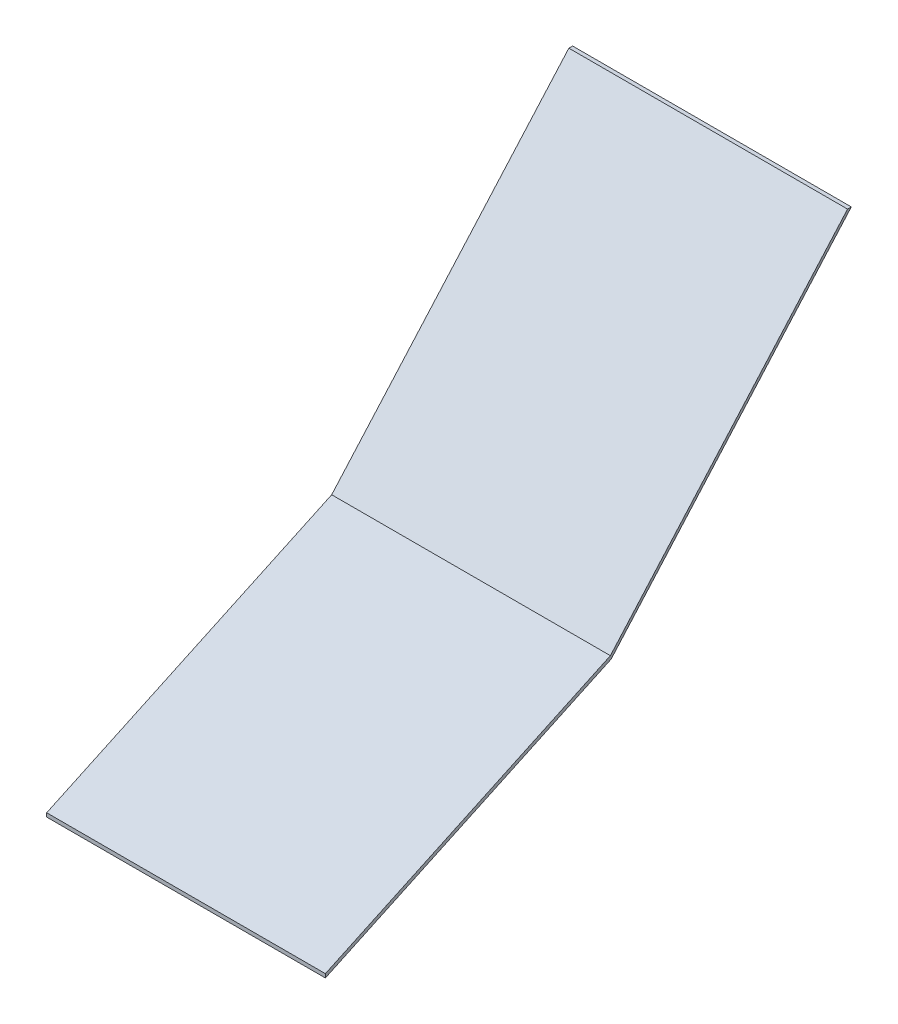
ISO-10303-21;
HEADER;
FILE_DESCRIPTION(('STEP AP214'),'2;1');
FILE_NAME('part.step','',(''),(''),'','','');
FILE_SCHEMA(('AUTOMOTIVE_DESIGN { 1 0 10303 214 1 1 1 1 }'));
ENDSEC;
DATA;
#1=APPLICATION_CONTEXT('core data for automotive mechanical design processes');
#2=APPLICATION_PROTOCOL_DEFINITION('international standard','automotive_design',2000,#1);
#3=PRODUCT_CONTEXT('',#1,'mechanical');
#4=PRODUCT('Part','Part','',(#3));
#5=PRODUCT_RELATED_PRODUCT_CATEGORY('part','',(#4));
#6=PRODUCT_DEFINITION_FORMATION('','',#4);
#7=PRODUCT_DEFINITION_CONTEXT('part definition',#1,'design');
#8=PRODUCT_DEFINITION('design','',#6,#7);
#9=PRODUCT_DEFINITION_SHAPE('','',#8);
#10=(LENGTH_UNIT() NAMED_UNIT(*) SI_UNIT(.MILLI.,.METRE.));
#11=(NAMED_UNIT(*) PLANE_ANGLE_UNIT() SI_UNIT($,.RADIAN.));
#12=(NAMED_UNIT(*) SI_UNIT($,.STERADIAN.) SOLID_ANGLE_UNIT());
#13=UNCERTAINTY_MEASURE_WITH_UNIT(LENGTH_MEASURE(1.E-05),#10,'distance_accuracy_value','');
#14=(GEOMETRIC_REPRESENTATION_CONTEXT(3) GLOBAL_UNCERTAINTY_ASSIGNED_CONTEXT((#13)) GLOBAL_UNIT_ASSIGNED_CONTEXT((#10,
#11,#12)) REPRESENTATION_CONTEXT('',''));
#15=CARTESIAN_POINT('',(0.,0.,0.));
#16=DIRECTION('',(0.,0.,1.));
#17=DIRECTION('',(1.,0.,0.));
#18=AXIS2_PLACEMENT_3D('',#15,#16,#17);
#19=CARTESIAN_POINT('',(112.268,-1.51892,0.));
#20=DIRECTION('',(0.,0.,-1.));
#21=DIRECTION('',(-1.,0.,0.));
#22=AXIS2_PLACEMENT_3D('',#19,#20,#21);
#23=PLANE('',#22);
#24=DIRECTION('',(0.,-1.,0.));
#25=VECTOR('',#24,1.);
#26=CARTESIAN_POINT('',(0.,-1.51892,0.));
#27=LINE('',#26,#25);
#28=CARTESIAN_POINT('',(0.,0.,0.));
#29=VERTEX_POINT('',#28);
#30=CARTESIAN_POINT('',(0.,-1.51892,0.));
#31=VERTEX_POINT('',#30);
#32=EDGE_CURVE('E128',#29,#31,#27,.T.);
#33=ORIENTED_EDGE('',*,*,#32,.T.);
#34=DIRECTION('',(-1.,0.,0.));
#35=VECTOR('',#34,1.);
#36=CARTESIAN_POINT('',(112.268,-1.51892,0.));
#37=LINE('',#36,#35);
#38=CARTESIAN_POINT('',(112.268,-1.51892,0.));
#39=VERTEX_POINT('',#38);
#40=EDGE_CURVE('E11',#39,#31,#37,.T.);
#41=ORIENTED_EDGE('',*,*,#40,.F.);
#42=DIRECTION('',(0.,-1.,0.));
#43=VECTOR('',#42,1.);
#44=CARTESIAN_POINT('',(112.268,-1.51892,0.));
#45=LINE('',#44,#43);
#46=CARTESIAN_POINT('',(112.268,0.,0.));
#47=VERTEX_POINT('',#46);
#48=EDGE_CURVE('E144',#47,#39,#45,.T.);
#49=ORIENTED_EDGE('',*,*,#48,.F.);
#50=DIRECTION('',(-1.,0.,0.));
#51=VECTOR('',#50,1.);
#52=CARTESIAN_POINT('',(112.268,0.,0.));
#53=LINE('',#52,#51);
#54=EDGE_CURVE('E124',#47,#29,#53,.T.);
#55=ORIENTED_EDGE('',*,*,#54,.T.);
#56=EDGE_LOOP('',(#33,#41,#49,#55));
#57=FACE_BOUND('',#56,.T.);
#58=ADVANCED_FACE('F39',(#57),#23,.F.);
#59=CARTESIAN_POINT('',(112.268,52.1535992410685,-115.101088953655));
#60=DIRECTION('',(0.,0.906307787036651,0.422618261740697));
#61=DIRECTION('',(0.,-0.422618261740697,0.906307787036651));
#62=AXIS2_PLACEMENT_3D('',#59,#60,#61);
#63=PLANE('',#62);
#64=DIRECTION('',(0.,0.422618261740697,-0.906307787036651));
#65=VECTOR('',#64,1.);
#66=CARTESIAN_POINT('',(0.,52.1535992410685,-115.101088953655));
#67=LINE('',#66,#65);
#68=CARTESIAN_POINT('',(0.,52.1535992410685,-115.101088953655));
#69=VERTEX_POINT('',#68);
#70=EDGE_CURVE('E132',#31,#69,#67,.T.);
#71=ORIENTED_EDGE('',*,*,#70,.T.);
#72=DIRECTION('',(-1.,0.,0.));
#73=VECTOR('',#72,1.);
#74=CARTESIAN_POINT('',(112.268,52.1535992410685,-115.101088953655));
#75=LINE('',#74,#73);
#76=CARTESIAN_POINT('',(112.268,52.1535992410685,-115.101088953655));
#77=VERTEX_POINT('',#76);
#78=EDGE_CURVE('E48',#77,#69,#75,.T.);
#79=ORIENTED_EDGE('',*,*,#78,.F.);
#80=DIRECTION('',(0.,0.422618261740697,-0.906307787036651));
#81=VECTOR('',#80,1.);
#82=CARTESIAN_POINT('',(112.268,52.1535992410685,-115.101088953655));
#83=LINE('',#82,#81);
#84=EDGE_CURVE('E93',#39,#77,#83,.T.);
#85=ORIENTED_EDGE('',*,*,#84,.F.);
#86=ORIENTED_EDGE('',*,*,#40,.T.);
#87=EDGE_LOOP('',(#71,#79,#85,#86));
#88=FACE_BOUND('',#87,.T.);
#89=ADVANCED_FACE('F172',(#88),#63,.F.);
#90=CARTESIAN_POINT('',(112.268,161.555471134874,-211.857654240623));
#91=DIRECTION('',(0.,0.662489320691328,0.749071358396477));
#92=DIRECTION('',(0.,-0.749071358396477,0.662489320691328));
#93=AXIS2_PLACEMENT_3D('',#90,#91,#92);
#94=PLANE('',#93);
#95=DIRECTION('',(0.,0.749071358396477,-0.662489320691328));
#96=VECTOR('',#95,1.);
#97=CARTESIAN_POINT('',(0.,161.555471134874,-211.857654240623));
#98=LINE('',#97,#96);
#99=CARTESIAN_POINT('',(0.,161.555471134874,-211.857654240623));
#100=VERTEX_POINT('',#99);
#101=EDGE_CURVE('E135',#69,#100,#98,.T.);
#102=ORIENTED_EDGE('',*,*,#101,.T.);
#103=DIRECTION('',(-1.,0.,0.));
#104=VECTOR('',#103,1.);
#105=CARTESIAN_POINT('',(112.268,161.555471134874,-211.857654240623));
#106=LINE('',#105,#104);
#107=CARTESIAN_POINT('',(112.268,161.555471134874,-211.857654240623));
#108=VERTEX_POINT('',#107);
#109=EDGE_CURVE('E117',#108,#100,#106,.T.);
#110=ORIENTED_EDGE('',*,*,#109,.F.);
#111=DIRECTION('',(0.,0.749071358396477,-0.662489320691328));
#112=VECTOR('',#111,1.);
#113=CARTESIAN_POINT('',(112.268,161.555471134874,-211.857654240623));
#114=LINE('',#113,#112);
#115=EDGE_CURVE('E106',#77,#108,#114,.T.);
#116=ORIENTED_EDGE('',*,*,#115,.F.);
#117=ORIENTED_EDGE('',*,*,#78,.T.);
#118=EDGE_LOOP('',(#102,#110,#116,#117));
#119=FACE_BOUND('',#118,.T.);
#120=ADVANCED_FACE('F154',(#119),#94,.F.);
#121=CARTESIAN_POINT('',(112.268,161.555471134874,-210.338734240623));
#122=DIRECTION('',(0.,-1.,0.));
#123=DIRECTION('',(0.,0.,-1.));
#124=AXIS2_PLACEMENT_3D('',#121,#122,#123);
#125=PLANE('',#124);
#126=DIRECTION('',(0.,0.,1.));
#127=VECTOR('',#126,1.);
#128=CARTESIAN_POINT('',(0.,161.555471134874,-210.338734240623));
#129=LINE('',#128,#127);
#130=CARTESIAN_POINT('',(0.,161.555471134874,-210.338734240623));
#131=VERTEX_POINT('',#130);
#132=EDGE_CURVE('E115',#100,#131,#129,.T.);
#133=ORIENTED_EDGE('',*,*,#132,.T.);
#134=DIRECTION('',(-1.,0.,0.));
#135=VECTOR('',#134,1.);
#136=CARTESIAN_POINT('',(112.268,161.555471134874,-210.338734240623));
#137=LINE('',#136,#135);
#138=CARTESIAN_POINT('',(112.268,161.555471134874,-210.338734240623));
#139=VERTEX_POINT('',#138);
#140=EDGE_CURVE('E112',#139,#131,#137,.T.);
#141=ORIENTED_EDGE('',*,*,#140,.F.);
#142=DIRECTION('',(0.,0.,1.));
#143=VECTOR('',#142,1.);
#144=CARTESIAN_POINT('',(112.268,161.555471134874,-210.338734240623));
#145=LINE('',#144,#143);
#146=EDGE_CURVE('E100',#108,#139,#145,.T.);
#147=ORIENTED_EDGE('',*,*,#146,.F.);
#148=ORIENTED_EDGE('',*,*,#109,.T.);
#149=EDGE_LOOP('',(#133,#141,#147,#148));
#150=FACE_BOUND('',#149,.T.);
#151=ADVANCED_FACE('F113',(#150),#125,.F.);
#152=CARTESIAN_POINT('',(112.268,53.5331916920555,-114.802300060579));
#153=DIRECTION('',(0.,-0.662489320691328,-0.749071358396477));
#154=DIRECTION('',(0.,0.749071358396477,-0.662489320691328));
#155=AXIS2_PLACEMENT_3D('',#152,#153,#154);
#156=PLANE('',#155);
#157=DIRECTION('',(0.,-0.749071358396477,0.662489320691328));
#158=VECTOR('',#157,1.);
#159=CARTESIAN_POINT('',(0.,53.5331916920555,-114.802300060579));
#160=LINE('',#159,#158);
#161=CARTESIAN_POINT('',(0.,53.5331916920555,-114.802300060579));
#162=VERTEX_POINT('',#161);
#163=EDGE_CURVE('E79',#131,#162,#160,.T.);
#164=ORIENTED_EDGE('',*,*,#163,.T.);
#165=DIRECTION('',(-1.,0.,0.));
#166=VECTOR('',#165,1.);
#167=CARTESIAN_POINT('',(112.268,53.5331916920555,-114.802300060579));
#168=LINE('',#167,#166);
#169=CARTESIAN_POINT('',(112.268,53.5331916920555,-114.802300060579));
#170=VERTEX_POINT('',#169);
#171=EDGE_CURVE('E118',#170,#162,#168,.T.);
#172=ORIENTED_EDGE('',*,*,#171,.F.);
#173=DIRECTION('',(0.,-0.749071358396477,0.662489320691328));
#174=VECTOR('',#173,1.);
#175=CARTESIAN_POINT('',(112.268,53.5331916920555,-114.802300060579));
#176=LINE('',#175,#174);
#177=EDGE_CURVE('E104',#139,#170,#176,.T.);
#178=ORIENTED_EDGE('',*,*,#177,.F.);
#179=ORIENTED_EDGE('',*,*,#140,.T.);
#180=EDGE_LOOP('',(#164,#172,#178,#179));
#181=FACE_BOUND('',#180,.T.);
#182=ADVANCED_FACE('F120',(#181),#156,.F.);
#183=CARTESIAN_POINT('',(112.268,0.,0.));
#184=DIRECTION('',(0.,-0.906307787036651,-0.422618261740697));
#185=DIRECTION('',(0.,0.422618261740697,-0.906307787036651));
#186=AXIS2_PLACEMENT_3D('',#183,#184,#185);
#187=PLANE('',#186);
#188=DIRECTION('',(0.,-0.422618261740697,0.906307787036651));
#189=VECTOR('',#188,1.);
#190=CARTESIAN_POINT('',(0.,0.,0.));
#191=LINE('',#190,#189);
#192=EDGE_CURVE('E85',#162,#29,#191,.T.);
#193=ORIENTED_EDGE('',*,*,#192,.T.);
#194=ORIENTED_EDGE('',*,*,#54,.F.);
#195=DIRECTION('',(0.,-0.422618261740697,0.906307787036651));
#196=VECTOR('',#195,1.);
#197=CARTESIAN_POINT('',(112.268,0.,0.));
#198=LINE('',#197,#196);
#199=EDGE_CURVE('E56',#170,#47,#198,.T.);
#200=ORIENTED_EDGE('',*,*,#199,.F.);
#201=ORIENTED_EDGE('',*,*,#171,.T.);
#202=EDGE_LOOP('',(#193,#194,#200,#201));
#203=FACE_BOUND('',#202,.T.);
#204=ADVANCED_FACE('F161',(#203),#187,.F.);
#205=CARTESIAN_POINT('',(112.268,0.,0.));
#206=DIRECTION('',(-1.,0.,0.));
#207=DIRECTION('',(0.,0.,1.));
#208=AXIS2_PLACEMENT_3D('',#205,#206,#207);
#209=PLANE('',#208);
#210=ORIENTED_EDGE('',*,*,#48,.T.);
#211=ORIENTED_EDGE('',*,*,#84,.T.);
#212=ORIENTED_EDGE('',*,*,#115,.T.);
#213=ORIENTED_EDGE('',*,*,#146,.T.);
#214=ORIENTED_EDGE('',*,*,#177,.T.);
#215=ORIENTED_EDGE('',*,*,#199,.T.);
#216=EDGE_LOOP('',(#210,#211,#212,#213,#214,#215));
#217=FACE_BOUND('',#216,.T.);
#218=ADVANCED_FACE('F102',(#217),#209,.F.);
#219=CARTESIAN_POINT('',(0.,0.,0.));
#220=DIRECTION('',(-1.,0.,0.));
#221=DIRECTION('',(0.,0.,1.));
#222=AXIS2_PLACEMENT_3D('',#219,#220,#221);
#223=PLANE('',#222);
#224=ORIENTED_EDGE('',*,*,#32,.F.);
#225=ORIENTED_EDGE('',*,*,#192,.F.);
#226=ORIENTED_EDGE('',*,*,#163,.F.);
#227=ORIENTED_EDGE('',*,*,#132,.F.);
#228=ORIENTED_EDGE('',*,*,#101,.F.);
#229=ORIENTED_EDGE('',*,*,#70,.F.);
#230=EDGE_LOOP('',(#224,#225,#226,#227,#228,#229));
#231=FACE_BOUND('',#230,.T.);
#232=ADVANCED_FACE('F157',(#231),#223,.T.);
#233=CLOSED_SHELL('',(#58,#89,#120,#151,#182,#204,#218,#232));
#234=MANIFOLD_SOLID_BREP('B2',#233);
#235=ADVANCED_BREP_SHAPE_REPRESENTATION('',(#18,#234),#14);
#236=SHAPE_DEFINITION_REPRESENTATION(#9,#235);
ENDSEC;
END-ISO-10303-21;
